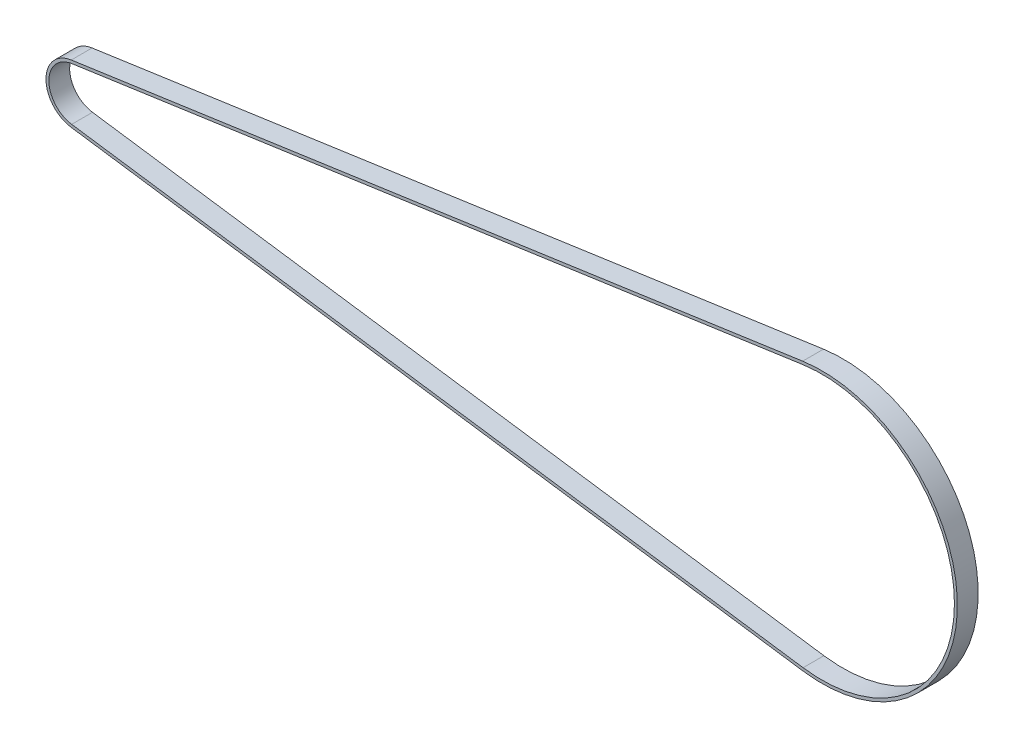
ISO-10303-21;
HEADER;
FILE_DESCRIPTION(('STEP AP214'),'2;1');
FILE_NAME('part.step','',(''),(''),'','','');
FILE_SCHEMA(('AUTOMOTIVE_DESIGN { 1 0 10303 214 1 1 1 1 }'));
ENDSEC;
DATA;
#1=APPLICATION_CONTEXT('core data for automotive mechanical design processes');
#2=APPLICATION_PROTOCOL_DEFINITION('international standard','automotive_design',2000,#1);
#3=PRODUCT_CONTEXT('',#1,'mechanical');
#4=PRODUCT('Part','Part','',(#3));
#5=PRODUCT_RELATED_PRODUCT_CATEGORY('part','',(#4));
#6=PRODUCT_DEFINITION_FORMATION('','',#4);
#7=PRODUCT_DEFINITION_CONTEXT('part definition',#1,'design');
#8=PRODUCT_DEFINITION('design','',#6,#7);
#9=PRODUCT_DEFINITION_SHAPE('','',#8);
#10=(LENGTH_UNIT() NAMED_UNIT(*) SI_UNIT(.MILLI.,.METRE.));
#11=(NAMED_UNIT(*) PLANE_ANGLE_UNIT() SI_UNIT($,.RADIAN.));
#12=(NAMED_UNIT(*) SI_UNIT($,.STERADIAN.) SOLID_ANGLE_UNIT());
#13=UNCERTAINTY_MEASURE_WITH_UNIT(LENGTH_MEASURE(1.E-05),#10,'distance_accuracy_value','');
#14=(GEOMETRIC_REPRESENTATION_CONTEXT(3) GLOBAL_UNCERTAINTY_ASSIGNED_CONTEXT((#13)) GLOBAL_UNIT_ASSIGNED_CONTEXT((#10,
#11,#12)) REPRESENTATION_CONTEXT('',''));
#15=CARTESIAN_POINT('',(0.,0.,0.));
#16=DIRECTION('',(0.,0.,1.));
#17=DIRECTION('',(1.,0.,0.));
#18=AXIS2_PLACEMENT_3D('',#15,#16,#17);
#19=CARTESIAN_POINT('',(-1.36279876272738E-11,-1.1740608485411E-11,14.224));
#20=DIRECTION('',(0.,0.,-1.));
#21=DIRECTION('',(-1.,0.,0.));
#22=AXIS2_PLACEMENT_3D('',#19,#20,#21);
#23=PLANE('',#22);
#24=CARTESIAN_POINT('',(-1.36279876272738E-11,-1.1740608485411E-11,14.224));
#25=DIRECTION('',(0.,0.,-1.));
#26=DIRECTION('',(-1.,0.,0.));
#27=AXIS2_PLACEMENT_3D('',#24,#25,#26);
#28=CIRCLE('',#27,20.161);
#29=CARTESIAN_POINT('',(-2.86167605883749,19.9568717772572,14.224));
#30=VERTEX_POINT('',#29);
#31=CARTESIAN_POINT('',(-2.86167605883653,-19.9568717772809,14.224));
#32=VERTEX_POINT('',#31);
#33=EDGE_CURVE('E160',#30,#32,#28,.F.);
#34=ORIENTED_EDGE('',*,*,#33,.T.);
#35=DIRECTION('',(0.989875094353906,-0.141941176470559,0.));
#36=VECTOR('',#35,1.);
#37=CARTESIAN_POINT('',(-2.86167605883657,-19.9568717772808,14.224));
#38=LINE('',#37,#36);
#39=CARTESIAN_POINT('',(496.863202176483,-91.6139298575483,14.224));
#40=VERTEX_POINT('',#39);
#41=EDGE_CURVE('E163',#32,#40,#38,.T.);
#42=ORIENTED_EDGE('',*,*,#41,.T.);
#43=CARTESIAN_POINT('',(510.000000000009,0.,14.224));
#44=DIRECTION('',(0.,0.,-1.));
#45=DIRECTION('',(-1.,0.,0.));
#46=AXIS2_PLACEMENT_3D('',#43,#44,#45);
#47=CIRCLE('',#46,92.551);
#48=CARTESIAN_POINT('',(496.863202176478,91.6139298575478,14.224));
#49=VERTEX_POINT('',#48);
#50=EDGE_CURVE('E166',#40,#49,#47,.F.);
#51=ORIENTED_EDGE('',*,*,#50,.T.);
#52=DIRECTION('',(-0.989875094353899,-0.141941176470605,0.));
#53=VECTOR('',#52,1.);
#54=CARTESIAN_POINT('',(-2.86167605883749,19.9568717772572,14.224));
#55=LINE('',#54,#53);
#56=EDGE_CURVE('E168',#49,#30,#55,.T.);
#57=ORIENTED_EDGE('',*,*,#56,.T.);
#58=EDGE_LOOP('',(#34,#42,#51,#57));
#59=FACE_BOUND('',#58,.T.);
#60=CARTESIAN_POINT('',(-1.36279876272738E-11,-1.1740608485411E-11,14.224));
#61=DIRECTION('',(0.,0.,1.));
#62=DIRECTION('',(-1.,0.,0.));
#63=AXIS2_PLACEMENT_3D('',#60,#61,#62);
#64=CIRCLE('',#63,18.161);
#65=CARTESIAN_POINT('',(-2.57779370589628,17.9771215885494,14.224));
#66=VERTEX_POINT('',#65);
#67=CARTESIAN_POINT('',(-2.57779370589545,-17.977121588573,14.224));
#68=VERTEX_POINT('',#67);
#69=EDGE_CURVE('E124',#66,#68,#64,.T.);
#70=ORIENTED_EDGE('',*,*,#69,.F.);
#71=DIRECTION('',(-0.989875094353899,-0.141941176470605,0.));
#72=VECTOR('',#71,1.);
#73=CARTESIAN_POINT('',(-2.57779370589628,17.9771215885494,14.224));
#74=LINE('',#73,#72);
#75=CARTESIAN_POINT('',(497.14708452942,89.63417966884,14.224));
#76=VERTEX_POINT('',#75);
#77=EDGE_CURVE('E146',#76,#66,#74,.T.);
#78=ORIENTED_EDGE('',*,*,#77,.F.);
#79=CARTESIAN_POINT('',(510.000000000009,0.,14.224));
#80=DIRECTION('',(0.,0.,1.));
#81=DIRECTION('',(-1.,0.,0.));
#82=AXIS2_PLACEMENT_3D('',#79,#80,#81);
#83=CIRCLE('',#82,90.551);
#84=CARTESIAN_POINT('',(497.147084529424,-89.6341796688404,14.224));
#85=VERTEX_POINT('',#84);
#86=EDGE_CURVE('E144',#85,#76,#83,.T.);
#87=ORIENTED_EDGE('',*,*,#86,.F.);
#88=DIRECTION('',(0.989875094353906,-0.141941176470559,0.));
#89=VECTOR('',#88,1.);
#90=CARTESIAN_POINT('',(497.147084529424,-89.6341796688404,14.224));
#91=LINE('',#90,#89);
#92=EDGE_CURVE('E132',#68,#85,#91,.T.);
#93=ORIENTED_EDGE('',*,*,#92,.F.);
#94=EDGE_LOOP('',(#70,#78,#87,#93));
#95=FACE_BOUND('',#94,.T.);
#96=ADVANCED_FACE('F59',(#59,#95),#23,.F.);
#97=CARTESIAN_POINT('',(-1.36279876272738E-11,-1.1740608485411E-11,0.));
#98=DIRECTION('',(0.,0.,-1.));
#99=DIRECTION('',(-1.,0.,0.));
#100=AXIS2_PLACEMENT_3D('',#97,#98,#99);
#101=PLANE('',#100);
#102=CARTESIAN_POINT('',(-1.36279876272738E-11,-1.1740608485411E-11,0.));
#103=DIRECTION('',(0.,0.,-1.));
#104=DIRECTION('',(-1.,0.,0.));
#105=AXIS2_PLACEMENT_3D('',#102,#103,#104);
#106=CIRCLE('',#105,20.161);
#107=CARTESIAN_POINT('',(-2.86167605883749,19.9568717772572,0.));
#108=VERTEX_POINT('',#107);
#109=CARTESIAN_POINT('',(-2.86167605883653,-19.9568717772809,0.));
#110=VERTEX_POINT('',#109);
#111=EDGE_CURVE('E140',#108,#110,#106,.F.);
#112=ORIENTED_EDGE('',*,*,#111,.F.);
#113=DIRECTION('',(-0.989875094353899,-0.141941176470605,0.));
#114=VECTOR('',#113,1.);
#115=CARTESIAN_POINT('',(-2.86167605883749,19.9568717772572,0.));
#116=LINE('',#115,#114);
#117=CARTESIAN_POINT('',(496.863202176478,91.6139298575478,0.));
#118=VERTEX_POINT('',#117);
#119=EDGE_CURVE('E164',#118,#108,#116,.T.);
#120=ORIENTED_EDGE('',*,*,#119,.F.);
#121=CARTESIAN_POINT('',(510.000000000009,0.,0.));
#122=DIRECTION('',(0.,0.,-1.));
#123=DIRECTION('',(-1.,0.,0.));
#124=AXIS2_PLACEMENT_3D('',#121,#122,#123);
#125=CIRCLE('',#124,92.551);
#126=CARTESIAN_POINT('',(496.863202176483,-91.6139298575483,0.));
#127=VERTEX_POINT('',#126);
#128=EDGE_CURVE('E175',#127,#118,#125,.F.);
#129=ORIENTED_EDGE('',*,*,#128,.F.);
#130=DIRECTION('',(0.989875094353906,-0.141941176470559,0.));
#131=VECTOR('',#130,1.);
#132=CARTESIAN_POINT('',(-2.86167605883657,-19.9568717772808,0.));
#133=LINE('',#132,#131);
#134=EDGE_CURVE('E173',#110,#127,#133,.T.);
#135=ORIENTED_EDGE('',*,*,#134,.F.);
#136=EDGE_LOOP('',(#112,#120,#129,#135));
#137=FACE_BOUND('',#136,.T.);
#138=DIRECTION('',(-0.989875094353899,-0.141941176470605,0.));
#139=VECTOR('',#138,1.);
#140=CARTESIAN_POINT('',(-2.57779370589628,17.9771215885494,0.));
#141=LINE('',#140,#139);
#142=CARTESIAN_POINT('',(497.14708452942,89.63417966884,0.));
#143=VERTEX_POINT('',#142);
#144=CARTESIAN_POINT('',(-2.57779370589628,17.9771215885494,0.));
#145=VERTEX_POINT('',#144);
#146=EDGE_CURVE('E133',#143,#145,#141,.T.);
#147=ORIENTED_EDGE('',*,*,#146,.T.);
#148=CARTESIAN_POINT('',(-1.36279876272738E-11,-1.1740608485411E-11,0.));
#149=DIRECTION('',(0.,0.,1.));
#150=DIRECTION('',(-1.,0.,0.));
#151=AXIS2_PLACEMENT_3D('',#148,#149,#150);
#152=CIRCLE('',#151,18.161);
#153=CARTESIAN_POINT('',(-2.57779370589545,-17.977121588573,0.));
#154=VERTEX_POINT('',#153);
#155=EDGE_CURVE('E82',#145,#154,#152,.T.);
#156=ORIENTED_EDGE('',*,*,#155,.T.);
#157=DIRECTION('',(0.989875094353906,-0.141941176470559,0.));
#158=VECTOR('',#157,1.);
#159=CARTESIAN_POINT('',(497.147084529424,-89.6341796688404,0.));
#160=LINE('',#159,#158);
#161=CARTESIAN_POINT('',(497.147084529424,-89.6341796688404,0.));
#162=VERTEX_POINT('',#161);
#163=EDGE_CURVE('E139',#154,#162,#160,.T.);
#164=ORIENTED_EDGE('',*,*,#163,.T.);
#165=CARTESIAN_POINT('',(510.000000000009,0.,0.));
#166=DIRECTION('',(0.,0.,1.));
#167=DIRECTION('',(-1.,0.,0.));
#168=AXIS2_PLACEMENT_3D('',#165,#166,#167);
#169=CIRCLE('',#168,90.551);
#170=EDGE_CURVE('E152',#162,#143,#169,.T.);
#171=ORIENTED_EDGE('',*,*,#170,.T.);
#172=EDGE_LOOP('',(#147,#156,#164,#171));
#173=FACE_BOUND('',#172,.T.);
#174=ADVANCED_FACE('F193',(#137,#173),#101,.T.);
#175=CARTESIAN_POINT('',(-1.36279876272738E-11,-1.1740608485411E-11,14.224));
#176=DIRECTION('',(0.,0.,-1.));
#177=DIRECTION('',(-1.,0.,0.));
#178=AXIS2_PLACEMENT_3D('',#175,#176,#177);
#179=CYLINDRICAL_SURFACE('',#178,20.161);
#180=ORIENTED_EDGE('',*,*,#111,.T.);
#181=DIRECTION('',(0.,0.,-1.));
#182=VECTOR('',#181,1.);
#183=CARTESIAN_POINT('',(-2.86167605883653,-19.9568717772809,14.224));
#184=LINE('',#183,#182);
#185=EDGE_CURVE('E12',#32,#110,#184,.T.);
#186=ORIENTED_EDGE('',*,*,#185,.F.);
#187=ORIENTED_EDGE('',*,*,#33,.F.);
#188=DIRECTION('',(0.,0.,-1.));
#189=VECTOR('',#188,1.);
#190=CARTESIAN_POINT('',(-2.86167605883749,19.9568717772572,14.224));
#191=LINE('',#190,#189);
#192=EDGE_CURVE('E170',#30,#108,#191,.T.);
#193=ORIENTED_EDGE('',*,*,#192,.T.);
#194=EDGE_LOOP('',(#180,#186,#187,#193));
#195=FACE_BOUND('',#194,.T.);
#196=ADVANCED_FACE('F61',(#195),#179,.T.);
#197=CARTESIAN_POINT('',(-2.86167605883657,-19.9568717772808,14.224));
#198=DIRECTION('',(0.141941176470559,0.989875094353906,0.));
#199=DIRECTION('',(-0.989875094353906,0.141941176470559,0.));
#200=AXIS2_PLACEMENT_3D('',#197,#198,#199);
#201=PLANE('',#200);
#202=ORIENTED_EDGE('',*,*,#134,.T.);
#203=DIRECTION('',(0.,0.,-1.));
#204=VECTOR('',#203,1.);
#205=CARTESIAN_POINT('',(496.863202176483,-91.6139298575483,14.224));
#206=LINE('',#205,#204);
#207=EDGE_CURVE('E67',#40,#127,#206,.T.);
#208=ORIENTED_EDGE('',*,*,#207,.F.);
#209=ORIENTED_EDGE('',*,*,#41,.F.);
#210=ORIENTED_EDGE('',*,*,#185,.T.);
#211=EDGE_LOOP('',(#202,#208,#209,#210));
#212=FACE_BOUND('',#211,.T.);
#213=ADVANCED_FACE('F203',(#212),#201,.F.);
#214=CARTESIAN_POINT('',(510.000000000009,0.,14.224));
#215=DIRECTION('',(0.,0.,-1.));
#216=DIRECTION('',(-1.,0.,0.));
#217=AXIS2_PLACEMENT_3D('',#214,#215,#216);
#218=CYLINDRICAL_SURFACE('',#217,92.551);
#219=ORIENTED_EDGE('',*,*,#128,.T.);
#220=DIRECTION('',(0.,0.,-1.));
#221=VECTOR('',#220,1.);
#222=CARTESIAN_POINT('',(496.863202176478,91.6139298575478,14.224));
#223=LINE('',#222,#221);
#224=EDGE_CURVE('E180',#49,#118,#223,.T.);
#225=ORIENTED_EDGE('',*,*,#224,.F.);
#226=ORIENTED_EDGE('',*,*,#50,.F.);
#227=ORIENTED_EDGE('',*,*,#207,.T.);
#228=EDGE_LOOP('',(#219,#225,#226,#227));
#229=FACE_BOUND('',#228,.T.);
#230=ADVANCED_FACE('F187',(#229),#218,.T.);
#231=CARTESIAN_POINT('',(-2.86167605883749,19.9568717772572,14.224));
#232=DIRECTION('',(0.141941176470605,-0.989875094353899,0.));
#233=DIRECTION('',(0.989875094353899,0.141941176470605,0.));
#234=AXIS2_PLACEMENT_3D('',#231,#232,#233);
#235=PLANE('',#234);
#236=ORIENTED_EDGE('',*,*,#119,.T.);
#237=ORIENTED_EDGE('',*,*,#192,.F.);
#238=ORIENTED_EDGE('',*,*,#56,.F.);
#239=ORIENTED_EDGE('',*,*,#224,.T.);
#240=EDGE_LOOP('',(#236,#237,#238,#239));
#241=FACE_BOUND('',#240,.T.);
#242=ADVANCED_FACE('F197',(#241),#235,.F.);
#243=CARTESIAN_POINT('',(-1.36279876272738E-11,-1.1740608485411E-11,14.224));
#244=DIRECTION('',(0.,0.,-1.));
#245=DIRECTION('',(-1.,0.,0.));
#246=AXIS2_PLACEMENT_3D('',#243,#244,#245);
#247=CYLINDRICAL_SURFACE('',#246,18.161);
#248=ORIENTED_EDGE('',*,*,#155,.F.);
#249=DIRECTION('',(0.,0.,-1.));
#250=VECTOR('',#249,1.);
#251=CARTESIAN_POINT('',(-2.57779370589628,17.9771215885494,14.224));
#252=LINE('',#251,#250);
#253=EDGE_CURVE('E128',#66,#145,#252,.T.);
#254=ORIENTED_EDGE('',*,*,#253,.F.);
#255=ORIENTED_EDGE('',*,*,#69,.T.);
#256=DIRECTION('',(0.,0.,-1.));
#257=VECTOR('',#256,1.);
#258=CARTESIAN_POINT('',(-2.57779370589545,-17.977121588573,14.224));
#259=LINE('',#258,#257);
#260=EDGE_CURVE('E127',#68,#154,#259,.T.);
#261=ORIENTED_EDGE('',*,*,#260,.T.);
#262=EDGE_LOOP('',(#248,#254,#255,#261));
#263=FACE_BOUND('',#262,.T.);
#264=ADVANCED_FACE('F126',(#263),#247,.F.);
#265=CARTESIAN_POINT('',(497.147084529424,-89.6341796688404,14.224));
#266=DIRECTION('',(0.141941176470559,0.989875094353906,0.));
#267=DIRECTION('',(-0.989875094353906,0.141941176470559,0.));
#268=AXIS2_PLACEMENT_3D('',#265,#266,#267);
#269=PLANE('',#268);
#270=ORIENTED_EDGE('',*,*,#163,.F.);
#271=ORIENTED_EDGE('',*,*,#260,.F.);
#272=ORIENTED_EDGE('',*,*,#92,.T.);
#273=DIRECTION('',(0.,0.,-1.));
#274=VECTOR('',#273,1.);
#275=CARTESIAN_POINT('',(497.147084529424,-89.6341796688404,14.224));
#276=LINE('',#275,#274);
#277=EDGE_CURVE('E141',#85,#162,#276,.T.);
#278=ORIENTED_EDGE('',*,*,#277,.T.);
#279=EDGE_LOOP('',(#270,#271,#272,#278));
#280=FACE_BOUND('',#279,.T.);
#281=ADVANCED_FACE('F136',(#280),#269,.T.);
#282=CARTESIAN_POINT('',(510.000000000009,0.,14.224));
#283=DIRECTION('',(0.,0.,-1.));
#284=DIRECTION('',(-1.,0.,0.));
#285=AXIS2_PLACEMENT_3D('',#282,#283,#284);
#286=CYLINDRICAL_SURFACE('',#285,90.551);
#287=ORIENTED_EDGE('',*,*,#170,.F.);
#288=ORIENTED_EDGE('',*,*,#277,.F.);
#289=ORIENTED_EDGE('',*,*,#86,.T.);
#290=DIRECTION('',(0.,0.,-1.));
#291=VECTOR('',#290,1.);
#292=CARTESIAN_POINT('',(497.14708452942,89.63417966884,14.224));
#293=LINE('',#292,#291);
#294=EDGE_CURVE('E74',#76,#143,#293,.T.);
#295=ORIENTED_EDGE('',*,*,#294,.T.);
#296=EDGE_LOOP('',(#287,#288,#289,#295));
#297=FACE_BOUND('',#296,.T.);
#298=ADVANCED_FACE('F226',(#297),#286,.F.);
#299=CARTESIAN_POINT('',(-2.57779370589628,17.9771215885494,14.224));
#300=DIRECTION('',(0.141941176470605,-0.989875094353899,0.));
#301=DIRECTION('',(0.989875094353899,0.141941176470605,0.));
#302=AXIS2_PLACEMENT_3D('',#299,#300,#301);
#303=PLANE('',#302);
#304=ORIENTED_EDGE('',*,*,#146,.F.);
#305=ORIENTED_EDGE('',*,*,#294,.F.);
#306=ORIENTED_EDGE('',*,*,#77,.T.);
#307=ORIENTED_EDGE('',*,*,#253,.T.);
#308=EDGE_LOOP('',(#304,#305,#306,#307));
#309=FACE_BOUND('',#308,.T.);
#310=ADVANCED_FACE('F230',(#309),#303,.T.);
#311=CLOSED_SHELL('',(#96,#174,#196,#213,#230,#242,#264,#281,#298,#310));
#312=MANIFOLD_SOLID_BREP('B2',#311);
#313=ADVANCED_BREP_SHAPE_REPRESENTATION('',(#18,#312),#14);
#314=SHAPE_DEFINITION_REPRESENTATION(#9,#313);
ENDSEC;
END-ISO-10303-21;
